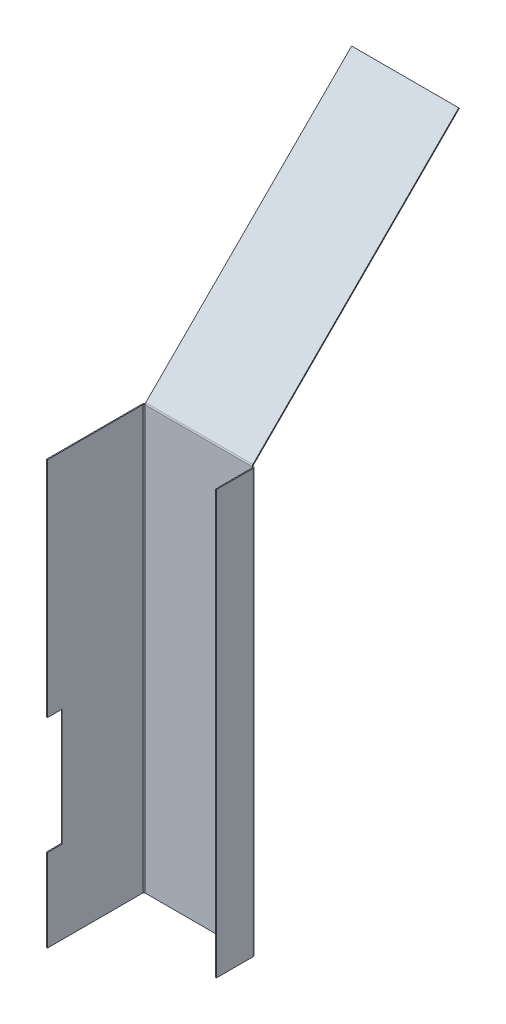
ISO-10303-21;
HEADER;
FILE_DESCRIPTION(('STEP AP214'),'2;1');
FILE_NAME('part.step','',(''),(''),'','','');
FILE_SCHEMA(('AUTOMOTIVE_DESIGN { 1 0 10303 214 1 1 1 1 }'));
ENDSEC;
DATA;
#1=APPLICATION_CONTEXT('core data for automotive mechanical design processes');
#2=APPLICATION_PROTOCOL_DEFINITION('international standard','automotive_design',2000,#1);
#3=PRODUCT_CONTEXT('',#1,'mechanical');
#4=PRODUCT('Part','Part','',(#3));
#5=PRODUCT_RELATED_PRODUCT_CATEGORY('part','',(#4));
#6=PRODUCT_DEFINITION_FORMATION('','',#4);
#7=PRODUCT_DEFINITION_CONTEXT('part definition',#1,'design');
#8=PRODUCT_DEFINITION('design','',#6,#7);
#9=PRODUCT_DEFINITION_SHAPE('','',#8);
#10=(LENGTH_UNIT() NAMED_UNIT(*) SI_UNIT(.MILLI.,.METRE.));
#11=(NAMED_UNIT(*) PLANE_ANGLE_UNIT() SI_UNIT($,.RADIAN.));
#12=(NAMED_UNIT(*) SI_UNIT($,.STERADIAN.) SOLID_ANGLE_UNIT());
#13=UNCERTAINTY_MEASURE_WITH_UNIT(LENGTH_MEASURE(1.E-05),#10,'distance_accuracy_value','');
#14=(GEOMETRIC_REPRESENTATION_CONTEXT(3) GLOBAL_UNCERTAINTY_ASSIGNED_CONTEXT((#13)) GLOBAL_UNIT_ASSIGNED_CONTEXT((#10,
#11,#12)) REPRESENTATION_CONTEXT('',''));
#15=CARTESIAN_POINT('',(0.,0.,0.));
#16=DIRECTION('',(0.,0.,1.));
#17=DIRECTION('',(1.,0.,0.));
#18=AXIS2_PLACEMENT_3D('',#15,#16,#17);
#19=CARTESIAN_POINT('',(-1.37160000000022,275.783864677849,62.865));
#20=DIRECTION('',(0.,0.,-1.));
#21=DIRECTION('',(-1.,0.,0.));
#22=AXIS2_PLACEMENT_3D('',#19,#20,#21);
#23=PLANE('',#22);
#24=DIRECTION('',(0.,1.,0.));
#25=VECTOR('',#24,1.);
#26=CARTESIAN_POINT('',(-1.37160000000022,0.,62.865));
#27=LINE('',#26,#25);
#28=CARTESIAN_POINT('',(-1.37160000000022,130.175,62.865));
#29=VERTEX_POINT('',#28);
#30=CARTESIAN_POINT('',(-1.37160000000022,275.783864677849,62.865));
#31=VERTEX_POINT('',#30);
#32=EDGE_CURVE('E213',#29,#31,#27,.T.);
#33=ORIENTED_EDGE('',*,*,#32,.F.);
#34=DIRECTION('',(-1.,0.,0.));
#35=VECTOR('',#34,1.);
#36=CARTESIAN_POINT('',(71.2226000000001,130.175,62.8650000000003));
#37=LINE('',#36,#35);
#38=CARTESIAN_POINT('',(-0.736600000000217,130.175,62.865));
#39=VERTEX_POINT('',#38);
#40=EDGE_CURVE('E448',#39,#29,#37,.T.);
#41=ORIENTED_EDGE('',*,*,#40,.F.);
#42=DIRECTION('',(0.,-1.,0.));
#43=VECTOR('',#42,1.);
#44=CARTESIAN_POINT('',(-0.736600000000217,275.783864677849,62.865));
#45=LINE('',#44,#43);
#46=CARTESIAN_POINT('',(-0.736600000000217,275.783864677849,62.865));
#47=VERTEX_POINT('',#46);
#48=EDGE_CURVE('E223',#39,#47,#45,.F.);
#49=ORIENTED_EDGE('',*,*,#48,.T.);
#50=DIRECTION('',(1.,0.,0.));
#51=VECTOR('',#50,1.);
#52=CARTESIAN_POINT('',(-1.37160000000022,275.783864677849,62.865));
#53=LINE('',#52,#51);
#54=EDGE_CURVE('E204',#31,#47,#53,.T.);
#55=ORIENTED_EDGE('',*,*,#54,.F.);
#56=EDGE_LOOP('',(#33,#41,#49,#55));
#57=FACE_BOUND('',#56,.T.);
#58=ADVANCED_FACE('F79',(#57),#23,.F.);
#59=CARTESIAN_POINT('',(69.85,276.753732338925,-0.401732338924538));
#60=DIRECTION('',(1.,0.,0.));
#61=DIRECTION('',(0.,0.,-1.));
#62=AXIS2_PLACEMENT_3D('',#59,#60,#61);
#63=PLANE('',#62);
#64=DIRECTION('',(0.,-0.707106781186557,-0.707106781186538));
#65=VECTOR('',#64,1.);
#66=CARTESIAN_POINT('',(69.85,276.753732338925,-0.401732338924538));
#67=LINE('',#66,#65);
#68=CARTESIAN_POINT('',(69.85,276.753732338925,-0.401732338924538));
#69=VERTEX_POINT('',#68);
#70=CARTESIAN_POINT('',(69.85,276.304719532871,-0.850745144977998));
#71=VERTEX_POINT('',#70);
#72=EDGE_CURVE('E13',#69,#71,#67,.T.);
#73=ORIENTED_EDGE('',*,*,#72,.F.);
#74=CARTESIAN_POINT('',(69.85,275.783864677849,-1.3716));
#75=DIRECTION('',(1.,0.,0.));
#76=DIRECTION('',(0.,0.,-1.));
#77=AXIS2_PLACEMENT_3D('',#74,#75,#76);
#78=CIRCLE('',#77,1.3716);
#79=CARTESIAN_POINT('',(69.85,275.783864677849,0.));
#80=VERTEX_POINT('',#79);
#81=EDGE_CURVE('E185',#80,#69,#78,.F.);
#82=ORIENTED_EDGE('',*,*,#81,.F.);
#83=DIRECTION('',(0.,0.,1.));
#84=VECTOR('',#83,1.);
#85=CARTESIAN_POINT('',(69.85,275.783864677849,-0.635000000000001));
#86=LINE('',#85,#84);
#87=CARTESIAN_POINT('',(69.85,275.783864677849,-0.634999999999998));
#88=VERTEX_POINT('',#87);
#89=EDGE_CURVE('E87',#88,#80,#86,.T.);
#90=ORIENTED_EDGE('',*,*,#89,.F.);
#91=CARTESIAN_POINT('',(69.85,275.783864677849,-1.3716));
#92=DIRECTION('',(1.,0.,0.));
#93=DIRECTION('',(0.,0.,-1.));
#94=AXIS2_PLACEMENT_3D('',#91,#92,#93);
#95=CIRCLE('',#94,0.7366);
#96=EDGE_CURVE('E263',#88,#71,#95,.F.);
#97=ORIENTED_EDGE('',*,*,#96,.T.);
#98=EDGE_LOOP('',(#73,#82,#90,#97));
#99=FACE_BOUND('',#98,.T.);
#100=ADVANCED_FACE('F81',(#99),#63,.T.);
#101=CARTESIAN_POINT('',(69.85,275.783864677849,-0.635000000000001));
#102=DIRECTION('',(1.,0.,0.));
#103=DIRECTION('',(0.,0.,-1.));
#104=AXIS2_PLACEMENT_3D('',#101,#102,#103);
#105=PLANE('',#104);
#106=DIRECTION('',(0.,0.707106781186547,-0.707106781186548));
#107=VECTOR('',#106,1.);
#108=CARTESIAN_POINT('',(69.85,276.352,0.));
#109=LINE('',#108,#107);
#110=CARTESIAN_POINT('',(69.85,411.055841816037,-134.703841816037));
#111=VERTEX_POINT('',#110);
#112=EDGE_CURVE('E256',#69,#111,#109,.T.);
#113=ORIENTED_EDGE('',*,*,#112,.F.);
#114=ORIENTED_EDGE('',*,*,#72,.T.);
#115=DIRECTION('',(0.,0.707106781186547,-0.707106781186548));
#116=VECTOR('',#115,1.);
#117=CARTESIAN_POINT('',(69.85,275.902987193947,-0.449012806053457));
#118=LINE('',#117,#116);
#119=CARTESIAN_POINT('',(69.85,410.606829009984,-135.152854622091));
#120=VERTEX_POINT('',#119);
#121=EDGE_CURVE('E132',#71,#120,#118,.T.);
#122=ORIENTED_EDGE('',*,*,#121,.T.);
#123=DIRECTION('',(0.,-0.707106781186569,-0.707106781186526));
#124=VECTOR('',#123,1.);
#125=CARTESIAN_POINT('',(69.85,411.055841816037,-134.703841816037));
#126=LINE('',#125,#124);
#127=EDGE_CURVE('E252',#111,#120,#126,.T.);
#128=ORIENTED_EDGE('',*,*,#127,.F.);
#129=EDGE_LOOP('',(#113,#114,#122,#128));
#130=FACE_BOUND('',#129,.T.);
#131=ADVANCED_FACE('F348',(#130),#105,.T.);
#132=CARTESIAN_POINT('',(0.,275.783864677849,0.));
#133=DIRECTION('',(-1.,0.,0.));
#134=DIRECTION('',(0.,0.,1.));
#135=AXIS2_PLACEMENT_3D('',#132,#133,#134);
#136=PLANE('',#135);
#137=DIRECTION('',(0.,0.,-1.));
#138=VECTOR('',#137,1.);
#139=CARTESIAN_POINT('',(0.,275.783864677849,0.));
#140=LINE('',#139,#138);
#141=CARTESIAN_POINT('',(0.,275.783864677849,0.));
#142=VERTEX_POINT('',#141);
#143=CARTESIAN_POINT('',(0.,275.783864677849,-0.635000000000001));
#144=VERTEX_POINT('',#143);
#145=EDGE_CURVE('E299',#142,#144,#140,.T.);
#146=ORIENTED_EDGE('',*,*,#145,.F.);
#147=CARTESIAN_POINT('',(0.,275.783864677849,-1.3716));
#148=DIRECTION('',(1.,0.,0.));
#149=DIRECTION('',(0.,0.,-1.));
#150=AXIS2_PLACEMENT_3D('',#147,#148,#149);
#151=CIRCLE('',#150,1.3716);
#152=CARTESIAN_POINT('',(0.,276.753732338925,-0.401732338924538));
#153=VERTEX_POINT('',#152);
#154=EDGE_CURVE('E274',#142,#153,#151,.F.);
#155=ORIENTED_EDGE('',*,*,#154,.T.);
#156=DIRECTION('',(0.,0.707106781186557,0.707106781186538));
#157=VECTOR('',#156,1.);
#158=CARTESIAN_POINT('',(0.,276.304719532871,-0.850745144977998));
#159=LINE('',#158,#157);
#160=CARTESIAN_POINT('',(0.,276.304719532871,-0.850745144977998));
#161=VERTEX_POINT('',#160);
#162=EDGE_CURVE('E126',#161,#153,#159,.T.);
#163=ORIENTED_EDGE('',*,*,#162,.F.);
#164=CARTESIAN_POINT('',(0.,275.783864677849,-1.3716));
#165=DIRECTION('',(1.,0.,0.));
#166=DIRECTION('',(0.,0.,-1.));
#167=AXIS2_PLACEMENT_3D('',#164,#165,#166);
#168=CIRCLE('',#167,0.7366);
#169=EDGE_CURVE('E253',#144,#161,#168,.F.);
#170=ORIENTED_EDGE('',*,*,#169,.F.);
#171=EDGE_LOOP('',(#146,#155,#163,#170));
#172=FACE_BOUND('',#171,.T.);
#173=ADVANCED_FACE('F327',(#172),#136,.T.);
#174=CARTESIAN_POINT('',(69.85,275.902987193947,-0.449012806053457));
#175=DIRECTION('',(0.,0.707106781186548,0.707106781186547));
#176=DIRECTION('',(0.,-0.707106781186547,0.707106781186548));
#177=AXIS2_PLACEMENT_3D('',#174,#175,#176);
#178=PLANE('',#177);
#179=DIRECTION('',(0.,0.707106781186547,-0.707106781186548));
#180=VECTOR('',#179,1.);
#181=CARTESIAN_POINT('',(0.,275.902987193947,-0.449012806053457));
#182=LINE('',#181,#180);
#183=CARTESIAN_POINT('',(0.,410.606829009984,-135.152854622091));
#184=VERTEX_POINT('',#183);
#185=EDGE_CURVE('E242',#161,#184,#182,.T.);
#186=ORIENTED_EDGE('',*,*,#185,.T.);
#187=DIRECTION('',(-1.,0.,0.));
#188=VECTOR('',#187,1.);
#189=CARTESIAN_POINT('',(69.85,410.606829009984,-135.152854622091));
#190=LINE('',#189,#188);
#191=EDGE_CURVE('E296',#120,#184,#190,.T.);
#192=ORIENTED_EDGE('',*,*,#191,.F.);
#193=ORIENTED_EDGE('',*,*,#121,.F.);
#194=DIRECTION('',(-1.,0.,0.));
#195=VECTOR('',#194,1.);
#196=CARTESIAN_POINT('',(69.85,276.304719532871,-0.850745144977998));
#197=LINE('',#196,#195);
#198=EDGE_CURVE('E265',#71,#161,#197,.T.);
#199=ORIENTED_EDGE('',*,*,#198,.T.);
#200=EDGE_LOOP('',(#186,#192,#193,#199));
#201=FACE_BOUND('',#200,.T.);
#202=ADVANCED_FACE('F345',(#201),#178,.F.);
#203=CARTESIAN_POINT('',(69.85,411.055841816037,-134.703841816037));
#204=DIRECTION('',(0.,0.707106781186526,-0.70710678118657));
#205=DIRECTION('',(0.,0.707106781186569,0.707106781186526));
#206=AXIS2_PLACEMENT_3D('',#203,#204,#205);
#207=PLANE('',#206);
#208=DIRECTION('',(0.,-0.707106781186569,-0.707106781186526));
#209=VECTOR('',#208,1.);
#210=CARTESIAN_POINT('',(0.,411.055841816037,-134.703841816037));
#211=LINE('',#210,#209);
#212=CARTESIAN_POINT('',(0.,411.055841816037,-134.703841816037));
#213=VERTEX_POINT('',#212);
#214=EDGE_CURVE('E268',#213,#184,#211,.T.);
#215=ORIENTED_EDGE('',*,*,#214,.F.);
#216=DIRECTION('',(-1.,0.,0.));
#217=VECTOR('',#216,1.);
#218=CARTESIAN_POINT('',(69.85,411.055841816037,-134.703841816037));
#219=LINE('',#218,#217);
#220=EDGE_CURVE('E294',#111,#213,#219,.T.);
#221=ORIENTED_EDGE('',*,*,#220,.F.);
#222=ORIENTED_EDGE('',*,*,#127,.T.);
#223=ORIENTED_EDGE('',*,*,#191,.T.);
#224=EDGE_LOOP('',(#215,#221,#222,#223));
#225=FACE_BOUND('',#224,.T.);
#226=ADVANCED_FACE('F347',(#225),#207,.T.);
#227=CARTESIAN_POINT('',(69.85,276.352,0.));
#228=DIRECTION('',(0.,0.707106781186548,0.707106781186547));
#229=DIRECTION('',(0.,-0.707106781186547,0.707106781186548));
#230=AXIS2_PLACEMENT_3D('',#227,#228,#229);
#231=PLANE('',#230);
#232=DIRECTION('',(0.,0.707106781186547,-0.707106781186548));
#233=VECTOR('',#232,1.);
#234=CARTESIAN_POINT('',(0.,276.352,0.));
#235=LINE('',#234,#233);
#236=EDGE_CURVE('E271',#153,#213,#235,.T.);
#237=ORIENTED_EDGE('',*,*,#236,.F.);
#238=DIRECTION('',(-1.,0.,0.));
#239=VECTOR('',#238,1.);
#240=CARTESIAN_POINT('',(69.85,276.753732338925,-0.401732338924538));
#241=LINE('',#240,#239);
#242=EDGE_CURVE('E291',#69,#153,#241,.T.);
#243=ORIENTED_EDGE('',*,*,#242,.F.);
#244=ORIENTED_EDGE('',*,*,#112,.T.);
#245=ORIENTED_EDGE('',*,*,#220,.T.);
#246=EDGE_LOOP('',(#237,#243,#244,#245));
#247=FACE_BOUND('',#246,.T.);
#248=ADVANCED_FACE('F339',(#247),#231,.T.);
#249=CARTESIAN_POINT('',(69.85,275.783864677849,-1.3716));
#250=DIRECTION('',(-1.,0.,0.));
#251=DIRECTION('',(0.,0.,1.));
#252=AXIS2_PLACEMENT_3D('',#249,#250,#251);
#253=CYLINDRICAL_SURFACE('',#252,1.3716);
#254=ORIENTED_EDGE('',*,*,#154,.F.);
#255=DIRECTION('',(-1.,0.,0.));
#256=VECTOR('',#255,1.);
#257=CARTESIAN_POINT('',(69.85,275.783864677849,0.));
#258=LINE('',#257,#256);
#259=EDGE_CURVE('E161',#80,#142,#258,.T.);
#260=ORIENTED_EDGE('',*,*,#259,.F.);
#261=ORIENTED_EDGE('',*,*,#81,.T.);
#262=ORIENTED_EDGE('',*,*,#242,.T.);
#263=EDGE_LOOP('',(#254,#260,#261,#262));
#264=FACE_BOUND('',#263,.T.);
#265=ADVANCED_FACE('F335',(#264),#253,.T.);
#266=CARTESIAN_POINT('',(69.85,0.,0.));
#267=DIRECTION('',(0.,0.,1.));
#268=DIRECTION('',(1.,0.,0.));
#269=AXIS2_PLACEMENT_3D('',#266,#267,#268);
#270=PLANE('',#269);
#271=DIRECTION('',(0.,1.,0.));
#272=VECTOR('',#271,1.);
#273=CARTESIAN_POINT('',(0.,0.,0.));
#274=LINE('',#273,#272);
#275=CARTESIAN_POINT('',(0.,0.,0.));
#276=VERTEX_POINT('',#275);
#277=EDGE_CURVE('E158',#276,#142,#274,.T.);
#278=ORIENTED_EDGE('',*,*,#277,.F.);
#279=DIRECTION('',(-1.,0.,0.));
#280=VECTOR('',#279,1.);
#281=CARTESIAN_POINT('',(69.85,0.,0.));
#282=LINE('',#281,#280);
#283=CARTESIAN_POINT('',(69.85,0.,0.));
#284=VERTEX_POINT('',#283);
#285=EDGE_CURVE('E149',#284,#276,#282,.T.);
#286=ORIENTED_EDGE('',*,*,#285,.F.);
#287=DIRECTION('',(0.,1.,0.));
#288=VECTOR('',#287,1.);
#289=CARTESIAN_POINT('',(69.85,0.,0.));
#290=LINE('',#289,#288);
#291=EDGE_CURVE('E154',#284,#80,#290,.T.);
#292=ORIENTED_EDGE('',*,*,#291,.T.);
#293=ORIENTED_EDGE('',*,*,#259,.T.);
#294=EDGE_LOOP('',(#278,#286,#292,#293));
#295=FACE_BOUND('',#294,.T.);
#296=ADVANCED_FACE('F151',(#295),#270,.T.);
#297=CARTESIAN_POINT('',(69.85,0.,-0.635));
#298=DIRECTION('',(0.,-1.,0.));
#299=DIRECTION('',(0.,0.,-1.));
#300=AXIS2_PLACEMENT_3D('',#297,#298,#299);
#301=PLANE('',#300);
#302=DIRECTION('',(0.,0.,1.));
#303=VECTOR('',#302,1.);
#304=CARTESIAN_POINT('',(0.,0.,-0.635));
#305=LINE('',#304,#303);
#306=CARTESIAN_POINT('',(0.,0.,-0.63500000000001));
#307=VERTEX_POINT('',#306);
#308=EDGE_CURVE('E277',#307,#276,#305,.T.);
#309=ORIENTED_EDGE('',*,*,#308,.F.);
#310=DIRECTION('',(-1.,0.,0.));
#311=VECTOR('',#310,1.);
#312=CARTESIAN_POINT('',(69.85,0.,-0.635));
#313=LINE('',#312,#311);
#314=CARTESIAN_POINT('',(69.85,0.,-0.635));
#315=VERTEX_POINT('',#314);
#316=EDGE_CURVE('E162',#315,#307,#313,.T.);
#317=ORIENTED_EDGE('',*,*,#316,.F.);
#318=DIRECTION('',(0.,0.,1.));
#319=VECTOR('',#318,1.);
#320=CARTESIAN_POINT('',(69.85,0.,-0.635));
#321=LINE('',#320,#319);
#322=EDGE_CURVE('E165',#315,#284,#321,.T.);
#323=ORIENTED_EDGE('',*,*,#322,.T.);
#324=ORIENTED_EDGE('',*,*,#285,.T.);
#325=EDGE_LOOP('',(#309,#317,#323,#324));
#326=FACE_BOUND('',#325,.T.);
#327=ADVANCED_FACE('F166',(#326),#301,.T.);
#328=CARTESIAN_POINT('',(69.85,0.,-0.635));
#329=DIRECTION('',(0.,0.,1.));
#330=DIRECTION('',(1.,0.,0.));
#331=AXIS2_PLACEMENT_3D('',#328,#329,#330);
#332=PLANE('',#331);
#333=DIRECTION('',(0.,1.,0.));
#334=VECTOR('',#333,1.);
#335=CARTESIAN_POINT('',(0.,0.,-0.635));
#336=LINE('',#335,#334);
#337=EDGE_CURVE('E280',#307,#144,#336,.T.);
#338=ORIENTED_EDGE('',*,*,#337,.T.);
#339=DIRECTION('',(-1.,0.,0.));
#340=VECTOR('',#339,1.);
#341=CARTESIAN_POINT('',(69.85,275.783864677849,-0.635000000000001));
#342=LINE('',#341,#340);
#343=EDGE_CURVE('E286',#88,#144,#342,.T.);
#344=ORIENTED_EDGE('',*,*,#343,.F.);
#345=DIRECTION('',(0.,1.,0.));
#346=VECTOR('',#345,1.);
#347=CARTESIAN_POINT('',(69.85,0.,-0.635));
#348=LINE('',#347,#346);
#349=EDGE_CURVE('E173',#315,#88,#348,.T.);
#350=ORIENTED_EDGE('',*,*,#349,.F.);
#351=ORIENTED_EDGE('',*,*,#316,.T.);
#352=EDGE_LOOP('',(#338,#344,#350,#351));
#353=FACE_BOUND('',#352,.T.);
#354=ADVANCED_FACE('F322',(#353),#332,.F.);
#355=CARTESIAN_POINT('',(69.85,275.783864677849,-1.3716));
#356=DIRECTION('',(-1.,0.,0.));
#357=DIRECTION('',(0.,0.,1.));
#358=AXIS2_PLACEMENT_3D('',#355,#356,#357);
#359=CYLINDRICAL_SURFACE('',#358,0.7366);
#360=ORIENTED_EDGE('',*,*,#169,.T.);
#361=ORIENTED_EDGE('',*,*,#198,.F.);
#362=ORIENTED_EDGE('',*,*,#96,.F.);
#363=ORIENTED_EDGE('',*,*,#343,.T.);
#364=EDGE_LOOP('',(#360,#361,#362,#363));
#365=FACE_BOUND('',#364,.T.);
#366=ADVANCED_FACE('F325',(#365),#359,.F.);
#367=CARTESIAN_POINT('',(0.,275.783864677849,-1.3716));
#368=DIRECTION('',(1.,0.,0.));
#369=DIRECTION('',(0.,0.,-1.));
#370=AXIS2_PLACEMENT_3D('',#367,#368,#369);
#371=PLANE('',#370);
#372=ORIENTED_EDGE('',*,*,#185,.F.);
#373=ORIENTED_EDGE('',*,*,#162,.T.);
#374=ORIENTED_EDGE('',*,*,#236,.T.);
#375=ORIENTED_EDGE('',*,*,#214,.T.);
#376=EDGE_LOOP('',(#372,#373,#374,#375));
#377=FACE_BOUND('',#376,.T.);
#378=ADVANCED_FACE('F343',(#377),#371,.F.);
#379=CARTESIAN_POINT('',(0.,275.783864677849,0.7366));
#380=DIRECTION('',(0.,1.,0.));
#381=DIRECTION('',(-1.,0.,0.));
#382=AXIS2_PLACEMENT_3D('',#379,#380,#381);
#383=PLANE('',#382);
#384=DIRECTION('',(1.,0.,0.));
#385=VECTOR('',#384,1.);
#386=CARTESIAN_POINT('',(-1.3716,275.783864677849,0.736599999999995));
#387=LINE('',#386,#385);
#388=CARTESIAN_POINT('',(-0.7366,275.783864677849,0.736599999999997));
#389=VERTEX_POINT('',#388);
#390=CARTESIAN_POINT('',(-1.3716,275.783864677849,0.736599999999995));
#391=VERTEX_POINT('',#390);
#392=EDGE_CURVE('E236',#389,#391,#387,.F.);
#393=ORIENTED_EDGE('',*,*,#392,.F.);
#394=CARTESIAN_POINT('',(0.,275.783864677849,0.7366));
#395=DIRECTION('',(0.,-1.,0.));
#396=DIRECTION('',(1.,0.,0.));
#397=AXIS2_PLACEMENT_3D('',#394,#395,#396);
#398=CIRCLE('',#397,0.73660000000001);
#399=EDGE_CURVE('E246',#142,#389,#398,.F.);
#400=ORIENTED_EDGE('',*,*,#399,.F.);
#401=ORIENTED_EDGE('',*,*,#145,.T.);
#402=CARTESIAN_POINT('',(0.,275.783864677849,0.7366));
#403=DIRECTION('',(0.,-1.,0.));
#404=DIRECTION('',(1.,0.,0.));
#405=AXIS2_PLACEMENT_3D('',#402,#403,#404);
#406=CIRCLE('',#405,1.37160000000001);
#407=EDGE_CURVE('E239',#144,#391,#406,.F.);
#408=ORIENTED_EDGE('',*,*,#407,.T.);
#409=EDGE_LOOP('',(#393,#400,#401,#408));
#410=FACE_BOUND('',#409,.T.);
#411=ADVANCED_FACE('F552',(#410),#383,.T.);
#412=CARTESIAN_POINT('',(0.,0.,0.7366));
#413=DIRECTION('',(0.,1.,0.));
#414=DIRECTION('',(-1.,0.,0.));
#415=AXIS2_PLACEMENT_3D('',#412,#413,#414);
#416=PLANE('',#415);
#417=CARTESIAN_POINT('',(0.,0.,0.7366));
#418=DIRECTION('',(0.,-1.,0.));
#419=DIRECTION('',(1.,0.,0.));
#420=AXIS2_PLACEMENT_3D('',#417,#418,#419);
#421=CIRCLE('',#420,0.73660000000001);
#422=CARTESIAN_POINT('',(-0.73660000000002,0.,0.736599999999997));
#423=VERTEX_POINT('',#422);
#424=EDGE_CURVE('E203',#423,#276,#421,.T.);
#425=ORIENTED_EDGE('',*,*,#424,.F.);
#426=DIRECTION('',(1.,0.,0.));
#427=VECTOR('',#426,1.);
#428=CARTESIAN_POINT('',(-0.7366,0.,0.736599999999997));
#429=LINE('',#428,#427);
#430=CARTESIAN_POINT('',(-1.3716,0.,0.736599999999995));
#431=VERTEX_POINT('',#430);
#432=EDGE_CURVE('E230',#423,#431,#429,.F.);
#433=ORIENTED_EDGE('',*,*,#432,.T.);
#434=CARTESIAN_POINT('',(0.,0.,0.7366));
#435=DIRECTION('',(0.,-1.,0.));
#436=DIRECTION('',(1.,0.,0.));
#437=AXIS2_PLACEMENT_3D('',#434,#435,#436);
#438=CIRCLE('',#437,1.37160000000001);
#439=EDGE_CURVE('E243',#431,#307,#438,.T.);
#440=ORIENTED_EDGE('',*,*,#439,.T.);
#441=ORIENTED_EDGE('',*,*,#308,.T.);
#442=EDGE_LOOP('',(#425,#433,#440,#441));
#443=FACE_BOUND('',#442,.T.);
#444=ADVANCED_FACE('F550',(#443),#416,.F.);
#445=CARTESIAN_POINT('',(0.,0.,0.7366));
#446=DIRECTION('',(0.,-1.,0.));
#447=DIRECTION('',(-1.,0.,0.));
#448=AXIS2_PLACEMENT_3D('',#445,#446,#447);
#449=CYLINDRICAL_SURFACE('',#448,1.37160000000001);
#450=ORIENTED_EDGE('',*,*,#337,.F.);
#451=ORIENTED_EDGE('',*,*,#439,.F.);
#452=DIRECTION('',(0.,-1.,0.));
#453=VECTOR('',#452,1.);
#454=CARTESIAN_POINT('',(-1.3716,275.783864677849,0.736599999999995));
#455=LINE('',#454,#453);
#456=EDGE_CURVE('E227',#431,#391,#455,.F.);
#457=ORIENTED_EDGE('',*,*,#456,.T.);
#458=ORIENTED_EDGE('',*,*,#407,.F.);
#459=EDGE_LOOP('',(#450,#451,#457,#458));
#460=FACE_BOUND('',#459,.T.);
#461=ADVANCED_FACE('F545',(#460),#449,.T.);
#462=CARTESIAN_POINT('',(0.,0.,0.7366));
#463=DIRECTION('',(0.,-1.,0.));
#464=DIRECTION('',(-1.,0.,0.));
#465=AXIS2_PLACEMENT_3D('',#462,#463,#464);
#466=CYLINDRICAL_SURFACE('',#465,0.73660000000001);
#467=ORIENTED_EDGE('',*,*,#277,.T.);
#468=ORIENTED_EDGE('',*,*,#399,.T.);
#469=DIRECTION('',(0.,-1.,0.));
#470=VECTOR('',#469,1.);
#471=CARTESIAN_POINT('',(-0.7366,275.783864677849,0.736599999999997));
#472=LINE('',#471,#470);
#473=EDGE_CURVE('E233',#389,#423,#472,.T.);
#474=ORIENTED_EDGE('',*,*,#473,.T.);
#475=ORIENTED_EDGE('',*,*,#424,.T.);
#476=EDGE_LOOP('',(#467,#468,#474,#475));
#477=FACE_BOUND('',#476,.T.);
#478=ADVANCED_FACE('F541',(#477),#466,.F.);
#479=CARTESIAN_POINT('',(-1.37160000000022,0.,62.865));
#480=DIRECTION('',(0.,1.,0.));
#481=DIRECTION('',(0.,0.,1.));
#482=AXIS2_PLACEMENT_3D('',#479,#480,#481);
#483=PLANE('',#482);
#484=ORIENTED_EDGE('',*,*,#432,.F.);
#485=DIRECTION('',(0.,0.,-1.));
#486=VECTOR('',#485,1.);
#487=CARTESIAN_POINT('',(-0.736600000000217,0.,62.865));
#488=LINE('',#487,#486);
#489=CARTESIAN_POINT('',(-0.736600000000217,0.,62.865));
#490=VERTEX_POINT('',#489);
#491=EDGE_CURVE('E224',#423,#490,#488,.F.);
#492=ORIENTED_EDGE('',*,*,#491,.T.);
#493=DIRECTION('',(1.,0.,0.));
#494=VECTOR('',#493,1.);
#495=CARTESIAN_POINT('',(-1.37160000000022,0.,62.865));
#496=LINE('',#495,#494);
#497=CARTESIAN_POINT('',(-1.37160000000022,0.,62.865));
#498=VERTEX_POINT('',#497);
#499=EDGE_CURVE('E200',#498,#490,#496,.T.);
#500=ORIENTED_EDGE('',*,*,#499,.F.);
#501=DIRECTION('',(0.,0.,1.));
#502=VECTOR('',#501,1.);
#503=CARTESIAN_POINT('',(-1.3716,0.,0.));
#504=LINE('',#503,#502);
#505=EDGE_CURVE('E214',#431,#498,#504,.T.);
#506=ORIENTED_EDGE('',*,*,#505,.F.);
#507=EDGE_LOOP('',(#484,#492,#500,#506));
#508=FACE_BOUND('',#507,.T.);
#509=ADVANCED_FACE('F463',(#508),#483,.F.);
#510=CARTESIAN_POINT('',(-1.3716,275.783864677849,0.));
#511=DIRECTION('',(0.,-1.,0.));
#512=DIRECTION('',(0.,0.,-1.));
#513=AXIS2_PLACEMENT_3D('',#510,#511,#512);
#514=PLANE('',#513);
#515=ORIENTED_EDGE('',*,*,#392,.T.);
#516=DIRECTION('',(0.,0.,-1.));
#517=VECTOR('',#516,1.);
#518=CARTESIAN_POINT('',(-1.3716,275.783864677849,0.));
#519=LINE('',#518,#517);
#520=EDGE_CURVE('E207',#31,#391,#519,.T.);
#521=ORIENTED_EDGE('',*,*,#520,.F.);
#522=ORIENTED_EDGE('',*,*,#54,.T.);
#523=DIRECTION('',(0.,0.,1.));
#524=VECTOR('',#523,1.);
#525=CARTESIAN_POINT('',(-0.736599999999997,275.783864677849,0.));
#526=LINE('',#525,#524);
#527=EDGE_CURVE('E217',#47,#389,#526,.F.);
#528=ORIENTED_EDGE('',*,*,#527,.T.);
#529=EDGE_LOOP('',(#515,#521,#522,#528));
#530=FACE_BOUND('',#529,.T.);
#531=ADVANCED_FACE('F457',(#530),#514,.F.);
#532=CARTESIAN_POINT('',(-1.3716,0.,0.));
#533=DIRECTION('',(1.,0.,0.));
#534=DIRECTION('',(0.,0.,-1.));
#535=AXIS2_PLACEMENT_3D('',#532,#533,#534);
#536=PLANE('',#535);
#537=DIRECTION('',(0.,-1.,0.));
#538=VECTOR('',#537,1.);
#539=CARTESIAN_POINT('',(-1.37160000000018,53.975,53.2913571658386));
#540=LINE('',#539,#538);
#541=CARTESIAN_POINT('',(-1.37160000000018,130.175,53.2913571658386));
#542=VERTEX_POINT('',#541);
#543=CARTESIAN_POINT('',(-1.37160000000018,53.975,53.2913571658386));
#544=VERTEX_POINT('',#543);
#545=EDGE_CURVE('E451',#542,#544,#540,.T.);
#546=ORIENTED_EDGE('',*,*,#545,.F.);
#547=DIRECTION('',(0.,0.,-1.));
#548=VECTOR('',#547,1.);
#549=CARTESIAN_POINT('',(-1.37160000000018,130.175,53.2913571658386));
#550=LINE('',#549,#548);
#551=EDGE_CURVE('E465',#29,#542,#550,.T.);
#552=ORIENTED_EDGE('',*,*,#551,.F.);
#553=ORIENTED_EDGE('',*,*,#32,.T.);
#554=ORIENTED_EDGE('',*,*,#520,.T.);
#555=ORIENTED_EDGE('',*,*,#456,.F.);
#556=ORIENTED_EDGE('',*,*,#505,.T.);
#557=CARTESIAN_POINT('',(-1.37160000000022,53.975,62.865));
#558=VERTEX_POINT('',#557);
#559=EDGE_CURVE('E210',#498,#558,#27,.T.);
#560=ORIENTED_EDGE('',*,*,#559,.T.);
#561=DIRECTION('',(0.,0.,1.));
#562=VECTOR('',#561,1.);
#563=CARTESIAN_POINT('',(-1.37160000000022,53.9750000000002,62.865));
#564=LINE('',#563,#562);
#565=EDGE_CURVE('E94',#544,#558,#564,.T.);
#566=ORIENTED_EDGE('',*,*,#565,.F.);
#567=EDGE_LOOP('',(#546,#552,#553,#554,#555,#556,#560,#566));
#568=FACE_BOUND('',#567,.T.);
#569=ADVANCED_FACE('F372',(#568),#536,.F.);
#570=CARTESIAN_POINT('',(-0.736599999999997,0.,0.));
#571=DIRECTION('',(1.,0.,0.));
#572=DIRECTION('',(0.,0.,-1.));
#573=AXIS2_PLACEMENT_3D('',#570,#571,#572);
#574=PLANE('',#573);
#575=DIRECTION('',(0.,0.,-1.));
#576=VECTOR('',#575,1.);
#577=CARTESIAN_POINT('',(-0.736600000000184,130.175,53.2913571658386));
#578=LINE('',#577,#576);
#579=CARTESIAN_POINT('',(-0.736600000000184,130.175,53.2913571658386));
#580=VERTEX_POINT('',#579);
#581=EDGE_CURVE('E444',#39,#580,#578,.T.);
#582=ORIENTED_EDGE('',*,*,#581,.T.);
#583=DIRECTION('',(0.,-1.,0.));
#584=VECTOR('',#583,1.);
#585=CARTESIAN_POINT('',(-0.736600000000184,53.975,53.2913571658386));
#586=LINE('',#585,#584);
#587=CARTESIAN_POINT('',(-0.736600000000193,53.975,53.2913571658386));
#588=VERTEX_POINT('',#587);
#589=EDGE_CURVE('E452',#580,#588,#586,.T.);
#590=ORIENTED_EDGE('',*,*,#589,.T.);
#591=DIRECTION('',(0.,0.,1.));
#592=VECTOR('',#591,1.);
#593=CARTESIAN_POINT('',(-0.736600000000226,53.9750000000002,62.865));
#594=LINE('',#593,#592);
#595=CARTESIAN_POINT('',(-0.736600000000212,53.9750000000002,62.865));
#596=VERTEX_POINT('',#595);
#597=EDGE_CURVE('E389',#588,#596,#594,.T.);
#598=ORIENTED_EDGE('',*,*,#597,.T.);
#599=EDGE_CURVE('E220',#490,#596,#45,.F.);
#600=ORIENTED_EDGE('',*,*,#599,.F.);
#601=ORIENTED_EDGE('',*,*,#491,.F.);
#602=ORIENTED_EDGE('',*,*,#473,.F.);
#603=ORIENTED_EDGE('',*,*,#527,.F.);
#604=ORIENTED_EDGE('',*,*,#48,.F.);
#605=EDGE_LOOP('',(#582,#590,#598,#600,#601,#602,#603,#604));
#606=FACE_BOUND('',#605,.T.);
#607=ADVANCED_FACE('F365',(#606),#574,.T.);
#608=ORIENTED_EDGE('',*,*,#599,.T.);
#609=DIRECTION('',(-1.,0.,0.));
#610=VECTOR('',#609,1.);
#611=CARTESIAN_POINT('',(71.2226000000001,53.9750000000002,62.8650000000003));
#612=LINE('',#611,#610);
#613=EDGE_CURVE('E378',#596,#558,#612,.T.);
#614=ORIENTED_EDGE('',*,*,#613,.T.);
#615=ORIENTED_EDGE('',*,*,#559,.F.);
#616=ORIENTED_EDGE('',*,*,#499,.T.);
#617=EDGE_LOOP('',(#608,#614,#615,#616));
#618=FACE_BOUND('',#617,.T.);
#619=ADVANCED_FACE('F358',(#618),#23,.F.);
#620=CARTESIAN_POINT('',(69.85,0.,0.736600000000006));
#621=DIRECTION('',(0.,-1.,0.));
#622=DIRECTION('',(0.,0.,-1.));
#623=AXIS2_PLACEMENT_3D('',#620,#621,#622);
#624=PLANE('',#623);
#625=DIRECTION('',(-1.,0.,0.));
#626=VECTOR('',#625,1.);
#627=CARTESIAN_POINT('',(71.2216,0.,0.736600000000002));
#628=LINE('',#627,#626);
#629=CARTESIAN_POINT('',(70.5866,0.,0.736600000000004));
#630=VERTEX_POINT('',#629);
#631=CARTESIAN_POINT('',(71.2216,0.,0.736600000000002));
#632=VERTEX_POINT('',#631);
#633=EDGE_CURVE('E190',#630,#632,#628,.F.);
#634=ORIENTED_EDGE('',*,*,#633,.F.);
#635=CARTESIAN_POINT('',(69.85,0.,0.736600000000006));
#636=DIRECTION('',(0.,1.,0.));
#637=DIRECTION('',(0.,0.,1.));
#638=AXIS2_PLACEMENT_3D('',#635,#636,#637);
#639=CIRCLE('',#638,0.736600000000004);
#640=EDGE_CURVE('E181',#284,#630,#639,.F.);
#641=ORIENTED_EDGE('',*,*,#640,.F.);
#642=ORIENTED_EDGE('',*,*,#322,.F.);
#643=CARTESIAN_POINT('',(69.85,0.,0.736600000000006));
#644=DIRECTION('',(0.,1.,0.));
#645=DIRECTION('',(0.,0.,1.));
#646=AXIS2_PLACEMENT_3D('',#643,#644,#645);
#647=CIRCLE('',#646,1.3716);
#648=EDGE_CURVE('E194',#315,#632,#647,.F.);
#649=ORIENTED_EDGE('',*,*,#648,.T.);
#650=EDGE_LOOP('',(#634,#641,#642,#649));
#651=FACE_BOUND('',#650,.T.);
#652=ADVANCED_FACE('F188',(#651),#624,.T.);
#653=CARTESIAN_POINT('',(69.85,275.783864677849,0.736600000000006));
#654=DIRECTION('',(0.,-1.,0.));
#655=DIRECTION('',(0.,0.,-1.));
#656=AXIS2_PLACEMENT_3D('',#653,#654,#655);
#657=PLANE('',#656);
#658=CARTESIAN_POINT('',(69.85,275.783864677849,0.736600000000006));
#659=DIRECTION('',(0.,1.,0.));
#660=DIRECTION('',(0.,0.,1.));
#661=AXIS2_PLACEMENT_3D('',#658,#659,#660);
#662=CIRCLE('',#661,0.736600000000004);
#663=CARTESIAN_POINT('',(70.5866,275.783864677849,0.736600000000004));
#664=VERTEX_POINT('',#663);
#665=EDGE_CURVE('E184',#664,#80,#662,.T.);
#666=ORIENTED_EDGE('',*,*,#665,.F.);
#667=DIRECTION('',(-1.,0.,0.));
#668=VECTOR('',#667,1.);
#669=CARTESIAN_POINT('',(70.5866,275.783864677849,0.736600000000004));
#670=LINE('',#669,#668);
#671=CARTESIAN_POINT('',(71.2216,275.783864677849,0.736600000000002));
#672=VERTEX_POINT('',#671);
#673=EDGE_CURVE('E496',#664,#672,#670,.F.);
#674=ORIENTED_EDGE('',*,*,#673,.T.);
#675=CARTESIAN_POINT('',(69.85,275.783864677849,0.736600000000006));
#676=DIRECTION('',(0.,1.,0.));
#677=DIRECTION('',(0.,0.,1.));
#678=AXIS2_PLACEMENT_3D('',#675,#676,#677);
#679=CIRCLE('',#678,1.3716);
#680=EDGE_CURVE('E191',#672,#88,#679,.T.);
#681=ORIENTED_EDGE('',*,*,#680,.T.);
#682=ORIENTED_EDGE('',*,*,#89,.T.);
#683=EDGE_LOOP('',(#666,#674,#681,#682));
#684=FACE_BOUND('',#683,.T.);
#685=ADVANCED_FACE('F303',(#684),#657,.F.);
#686=CARTESIAN_POINT('',(69.85,275.783864677849,0.736600000000006));
#687=DIRECTION('',(0.,1.,0.));
#688=DIRECTION('',(1.,0.,0.));
#689=AXIS2_PLACEMENT_3D('',#686,#687,#688);
#690=CYLINDRICAL_SURFACE('',#689,1.3716);
#691=ORIENTED_EDGE('',*,*,#349,.T.);
#692=ORIENTED_EDGE('',*,*,#680,.F.);
#693=DIRECTION('',(0.,1.,0.));
#694=VECTOR('',#693,1.);
#695=CARTESIAN_POINT('',(71.2216,0.,0.736600000000002));
#696=LINE('',#695,#694);
#697=EDGE_CURVE('E494',#672,#632,#696,.F.);
#698=ORIENTED_EDGE('',*,*,#697,.T.);
#699=ORIENTED_EDGE('',*,*,#648,.F.);
#700=EDGE_LOOP('',(#691,#692,#698,#699));
#701=FACE_BOUND('',#700,.T.);
#702=ADVANCED_FACE('F317',(#701),#690,.T.);
#703=CARTESIAN_POINT('',(69.85,275.783864677849,0.736600000000006));
#704=DIRECTION('',(0.,1.,0.));
#705=DIRECTION('',(1.,0.,0.));
#706=AXIS2_PLACEMENT_3D('',#703,#704,#705);
#707=CYLINDRICAL_SURFACE('',#706,0.736600000000004);
#708=ORIENTED_EDGE('',*,*,#291,.F.);
#709=ORIENTED_EDGE('',*,*,#640,.T.);
#710=DIRECTION('',(0.,1.,0.));
#711=VECTOR('',#710,1.);
#712=CARTESIAN_POINT('',(70.5866,0.,0.736600000000004));
#713=LINE('',#712,#711);
#714=EDGE_CURVE('E498',#630,#664,#713,.T.);
#715=ORIENTED_EDGE('',*,*,#714,.T.);
#716=ORIENTED_EDGE('',*,*,#665,.T.);
#717=EDGE_LOOP('',(#708,#709,#715,#716));
#718=FACE_BOUND('',#717,.T.);
#719=ADVANCED_FACE('F178',(#718),#707,.F.);
#720=CARTESIAN_POINT('',(71.2216,0.,0.));
#721=DIRECTION('',(0.,1.,0.));
#722=DIRECTION('',(0.,0.,1.));
#723=AXIS2_PLACEMENT_3D('',#720,#721,#722);
#724=PLANE('',#723);
#725=ORIENTED_EDGE('',*,*,#633,.T.);
#726=DIRECTION('',(0.,0.,-1.));
#727=VECTOR('',#726,1.);
#728=CARTESIAN_POINT('',(71.2216,0.,-2.37071961243949E-13));
#729=LINE('',#728,#727);
#730=CARTESIAN_POINT('',(71.2216000000001,0.,24.765));
#731=VERTEX_POINT('',#730);
#732=EDGE_CURVE('E484',#731,#632,#729,.T.);
#733=ORIENTED_EDGE('',*,*,#732,.F.);
#734=DIRECTION('',(-1.,0.,0.));
#735=VECTOR('',#734,1.);
#736=CARTESIAN_POINT('',(71.2216000000001,0.,24.765));
#737=LINE('',#736,#735);
#738=CARTESIAN_POINT('',(70.5866000000001,0.,24.765));
#739=VERTEX_POINT('',#738);
#740=EDGE_CURVE('E477',#731,#739,#737,.T.);
#741=ORIENTED_EDGE('',*,*,#740,.T.);
#742=DIRECTION('',(0.,0.,1.));
#743=VECTOR('',#742,1.);
#744=CARTESIAN_POINT('',(70.5866,0.,0.));
#745=LINE('',#744,#743);
#746=EDGE_CURVE('E491',#739,#630,#745,.F.);
#747=ORIENTED_EDGE('',*,*,#746,.T.);
#748=EDGE_LOOP('',(#725,#733,#741,#747));
#749=FACE_BOUND('',#748,.T.);
#750=ADVANCED_FACE('F502',(#749),#724,.F.);
#751=CARTESIAN_POINT('',(71.2216000000001,275.783864677849,24.765));
#752=DIRECTION('',(0.,-1.,0.));
#753=DIRECTION('',(0.,0.,-1.));
#754=AXIS2_PLACEMENT_3D('',#751,#752,#753);
#755=PLANE('',#754);
#756=ORIENTED_EDGE('',*,*,#673,.F.);
#757=DIRECTION('',(0.,0.,-1.));
#758=VECTOR('',#757,1.);
#759=CARTESIAN_POINT('',(70.5866000000001,275.783864677849,24.765));
#760=LINE('',#759,#758);
#761=CARTESIAN_POINT('',(70.5866000000001,275.783864677849,24.765));
#762=VERTEX_POINT('',#761);
#763=EDGE_CURVE('E489',#664,#762,#760,.F.);
#764=ORIENTED_EDGE('',*,*,#763,.T.);
#765=DIRECTION('',(-1.,0.,0.));
#766=VECTOR('',#765,1.);
#767=CARTESIAN_POINT('',(71.2216000000001,275.783864677849,24.765));
#768=LINE('',#767,#766);
#769=CARTESIAN_POINT('',(71.2216000000001,275.783864677849,24.765));
#770=VERTEX_POINT('',#769);
#771=EDGE_CURVE('E196',#770,#762,#768,.T.);
#772=ORIENTED_EDGE('',*,*,#771,.F.);
#773=DIRECTION('',(0.,0.,1.));
#774=VECTOR('',#773,1.);
#775=CARTESIAN_POINT('',(71.2216,275.783864677849,-2.37071961243949E-13));
#776=LINE('',#775,#774);
#777=EDGE_CURVE('E482',#672,#770,#776,.T.);
#778=ORIENTED_EDGE('',*,*,#777,.F.);
#779=EDGE_LOOP('',(#756,#764,#772,#778));
#780=FACE_BOUND('',#779,.T.);
#781=ADVANCED_FACE('F518',(#780),#755,.F.);
#782=CARTESIAN_POINT('',(71.2216,0.,-2.37071961243949E-13));
#783=DIRECTION('',(-1.,0.,0.));
#784=DIRECTION('',(0.,0.,1.));
#785=AXIS2_PLACEMENT_3D('',#782,#783,#784);
#786=PLANE('',#785);
#787=ORIENTED_EDGE('',*,*,#697,.F.);
#788=ORIENTED_EDGE('',*,*,#777,.T.);
#789=DIRECTION('',(0.,-1.,0.));
#790=VECTOR('',#789,1.);
#791=CARTESIAN_POINT('',(71.2216000000001,0.,24.765));
#792=LINE('',#791,#790);
#793=EDGE_CURVE('E480',#770,#731,#792,.T.);
#794=ORIENTED_EDGE('',*,*,#793,.T.);
#795=ORIENTED_EDGE('',*,*,#732,.T.);
#796=EDGE_LOOP('',(#787,#788,#794,#795));
#797=FACE_BOUND('',#796,.T.);
#798=ADVANCED_FACE('F506',(#797),#786,.F.);
#799=CARTESIAN_POINT('',(70.5866,0.,-2.34854870593783E-13));
#800=DIRECTION('',(-1.,0.,0.));
#801=DIRECTION('',(0.,0.,1.));
#802=AXIS2_PLACEMENT_3D('',#799,#800,#801);
#803=PLANE('',#802);
#804=ORIENTED_EDGE('',*,*,#763,.F.);
#805=ORIENTED_EDGE('',*,*,#714,.F.);
#806=ORIENTED_EDGE('',*,*,#746,.F.);
#807=DIRECTION('',(0.,1.,0.));
#808=VECTOR('',#807,1.);
#809=CARTESIAN_POINT('',(70.5866000000001,0.,24.765));
#810=LINE('',#809,#808);
#811=EDGE_CURVE('E487',#762,#739,#810,.F.);
#812=ORIENTED_EDGE('',*,*,#811,.F.);
#813=EDGE_LOOP('',(#804,#805,#806,#812));
#814=FACE_BOUND('',#813,.T.);
#815=ADVANCED_FACE('F516',(#814),#803,.T.);
#816=CARTESIAN_POINT('',(71.2216000000001,0.,24.765));
#817=DIRECTION('',(0.,0.,-1.));
#818=DIRECTION('',(-1.,0.,0.));
#819=AXIS2_PLACEMENT_3D('',#816,#817,#818);
#820=PLANE('',#819);
#821=ORIENTED_EDGE('',*,*,#811,.T.);
#822=ORIENTED_EDGE('',*,*,#740,.F.);
#823=ORIENTED_EDGE('',*,*,#793,.F.);
#824=ORIENTED_EDGE('',*,*,#771,.T.);
#825=EDGE_LOOP('',(#821,#822,#823,#824));
#826=FACE_BOUND('',#825,.T.);
#827=ADVANCED_FACE('F512',(#826),#820,.F.);
#828=CARTESIAN_POINT('',(71.2226000000001,53.975,53.2913571658389));
#829=DIRECTION('',(0.,0.,-1.));
#830=DIRECTION('',(-1.,0.,0.));
#831=AXIS2_PLACEMENT_3D('',#828,#829,#830);
#832=PLANE('',#831);
#833=DIRECTION('',(-1.,0.,0.));
#834=VECTOR('',#833,1.);
#835=CARTESIAN_POINT('',(71.2226000000001,130.175,53.2913571658389));
#836=LINE('',#835,#834);
#837=EDGE_CURVE('E449',#580,#542,#836,.T.);
#838=ORIENTED_EDGE('',*,*,#837,.T.);
#839=ORIENTED_EDGE('',*,*,#545,.T.);
#840=DIRECTION('',(-1.,0.,0.));
#841=VECTOR('',#840,1.);
#842=CARTESIAN_POINT('',(71.2226000000001,53.975,53.2913571658389));
#843=LINE('',#842,#841);
#844=EDGE_CURVE('E467',#588,#544,#843,.T.);
#845=ORIENTED_EDGE('',*,*,#844,.F.);
#846=ORIENTED_EDGE('',*,*,#589,.F.);
#847=EDGE_LOOP('',(#838,#839,#845,#846));
#848=FACE_BOUND('',#847,.T.);
#849=ADVANCED_FACE('F783',(#848),#832,.F.);
#850=CARTESIAN_POINT('',(71.2226000000001,130.175,53.2913571658389));
#851=DIRECTION('',(0.,1.,0.));
#852=DIRECTION('',(0.,0.,1.));
#853=AXIS2_PLACEMENT_3D('',#850,#851,#852);
#854=PLANE('',#853);
#855=ORIENTED_EDGE('',*,*,#40,.T.);
#856=ORIENTED_EDGE('',*,*,#551,.T.);
#857=ORIENTED_EDGE('',*,*,#837,.F.);
#858=ORIENTED_EDGE('',*,*,#581,.F.);
#859=EDGE_LOOP('',(#855,#856,#857,#858));
#860=FACE_BOUND('',#859,.T.);
#861=ADVANCED_FACE('F446',(#860),#854,.F.);
#862=CARTESIAN_POINT('',(71.2226000000001,53.9750000000002,62.8650000000003));
#863=DIRECTION('',(0.,-1.,0.));
#864=DIRECTION('',(0.,0.,-1.));
#865=AXIS2_PLACEMENT_3D('',#862,#863,#864);
#866=PLANE('',#865);
#867=ORIENTED_EDGE('',*,*,#844,.T.);
#868=ORIENTED_EDGE('',*,*,#565,.T.);
#869=ORIENTED_EDGE('',*,*,#613,.F.);
#870=ORIENTED_EDGE('',*,*,#597,.F.);
#871=EDGE_LOOP('',(#867,#868,#869,#870));
#872=FACE_BOUND('',#871,.T.);
#873=ADVANCED_FACE('F806',(#872),#866,.F.);
#874=CLOSED_SHELL('',(#58,#100,#131,#173,#202,#226,#248,#265,#296,#327,#354,#366,#378,#411,#444,
#461,#478,#509,#531,#569,#607,#619,#652,#685,#702,#719,#750,#781,#798,#815,#827,#849,#861,#873));
#875=MANIFOLD_SOLID_BREP('B2',#874);
#876=ADVANCED_BREP_SHAPE_REPRESENTATION('',(#18,#875),#14);
#877=SHAPE_DEFINITION_REPRESENTATION(#9,#876);
ENDSEC;
END-ISO-10303-21;
